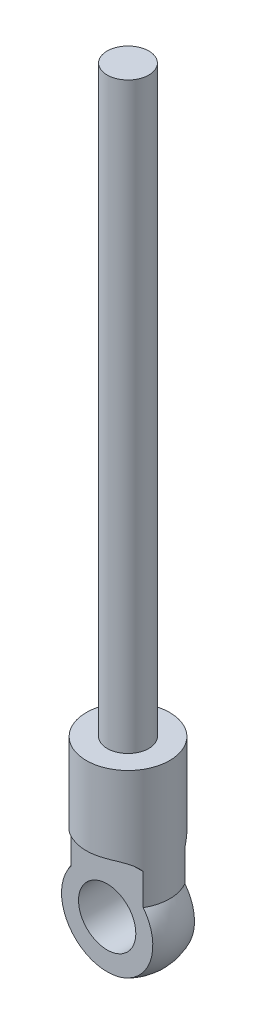
ISO-10303-21;
HEADER;
FILE_DESCRIPTION(('STEP AP214'),'2;1');
FILE_NAME('part.step','',(''),(''),'','','');
FILE_SCHEMA(('AUTOMOTIVE_DESIGN { 1 0 10303 214 1 1 1 1 }'));
ENDSEC;
DATA;
#1=APPLICATION_CONTEXT('core data for automotive mechanical design processes');
#2=APPLICATION_PROTOCOL_DEFINITION('international standard','automotive_design',2000,#1);
#3=PRODUCT_CONTEXT('',#1,'mechanical');
#4=PRODUCT('Part','Part','',(#3));
#5=PRODUCT_RELATED_PRODUCT_CATEGORY('part','',(#4));
#6=PRODUCT_DEFINITION_FORMATION('','',#4);
#7=PRODUCT_DEFINITION_CONTEXT('part definition',#1,'design');
#8=PRODUCT_DEFINITION('design','',#6,#7);
#9=PRODUCT_DEFINITION_SHAPE('','',#8);
#10=(LENGTH_UNIT() NAMED_UNIT(*) SI_UNIT(.MILLI.,.METRE.));
#11=(NAMED_UNIT(*) PLANE_ANGLE_UNIT() SI_UNIT($,.RADIAN.));
#12=(NAMED_UNIT(*) SI_UNIT($,.STERADIAN.) SOLID_ANGLE_UNIT());
#13=UNCERTAINTY_MEASURE_WITH_UNIT(LENGTH_MEASURE(1.E-05),#10,'distance_accuracy_value','');
#14=(GEOMETRIC_REPRESENTATION_CONTEXT(3) GLOBAL_UNCERTAINTY_ASSIGNED_CONTEXT((#13)) GLOBAL_UNIT_ASSIGNED_CONTEXT((#10,
#11,#12)) REPRESENTATION_CONTEXT('',''));
#15=CARTESIAN_POINT('',(0.,0.,0.));
#16=DIRECTION('',(0.,0.,1.));
#17=DIRECTION('',(1.,0.,0.));
#18=AXIS2_PLACEMENT_3D('',#15,#16,#17);
#19=CARTESIAN_POINT('',(0.,-14.1833333333333,0.));
#20=DIRECTION('',(0.,-1.,0.));
#21=DIRECTION('',(-1.,0.,0.));
#22=AXIS2_PLACEMENT_3D('',#19,#20,#21);
#23=SPHERICAL_SURFACE('',#22,4.81666666666666);
#24=CARTESIAN_POINT('',(0.,-14.1833333333333,2.));
#25=DIRECTION('',(0.,0.,-1.));
#26=DIRECTION('',(0.,1.,0.));
#27=AXIS2_PLACEMENT_3D('',#24,#25,#26);
#28=CIRCLE('',#27,4.38181215683395);
#29=CARTESIAN_POINT('',(3.46410161513775,-11.5,2.));
#30=VERTEX_POINT('',#29);
#31=CARTESIAN_POINT('',(-3.46410161513775,-11.5,2.));
#32=VERTEX_POINT('',#31);
#33=EDGE_CURVE('E167',#30,#32,#28,.T.);
#34=ORIENTED_EDGE('',*,*,#33,.T.);
#35=CARTESIAN_POINT('',(0.,-11.5,0.));
#36=DIRECTION('',(0.,-1.,0.));
#37=DIRECTION('',(0.,0.,-1.));
#38=AXIS2_PLACEMENT_3D('',#35,#36,#37);
#39=CIRCLE('',#38,4.);
#40=CARTESIAN_POINT('',(-3.46410161513775,-11.5,-2.));
#41=VERTEX_POINT('',#40);
#42=EDGE_CURVE('E170',#32,#41,#39,.T.);
#43=ORIENTED_EDGE('',*,*,#42,.T.);
#44=CARTESIAN_POINT('',(0.,-14.1833333333333,-2.));
#45=DIRECTION('',(0.,0.,-1.));
#46=DIRECTION('',(0.,1.,0.));
#47=AXIS2_PLACEMENT_3D('',#44,#45,#46);
#48=CIRCLE('',#47,4.38181215683394);
#49=CARTESIAN_POINT('',(3.46410161513775,-11.5,-2.));
#50=VERTEX_POINT('',#49);
#51=EDGE_CURVE('E74',#50,#41,#48,.T.);
#52=ORIENTED_EDGE('',*,*,#51,.F.);
#53=EDGE_CURVE('E111',#50,#30,#39,.T.);
#54=ORIENTED_EDGE('',*,*,#53,.T.);
#55=EDGE_LOOP('',(#34,#43,#52,#54));
#56=FACE_BOUND('',#55,.T.);
#57=ADVANCED_FACE('F51',(#56),#23,.T.);
#58=CARTESIAN_POINT('',(0.,0.,0.));
#59=DIRECTION('',(0.,-1.,0.));
#60=DIRECTION('',(0.,0.,-1.));
#61=AXIS2_PLACEMENT_3D('',#58,#59,#60);
#62=CYLINDRICAL_SURFACE('',#61,4.);
#63=CARTESIAN_POINT('',(0.,0.,0.));
#64=DIRECTION('',(0.,-1.,0.));
#65=DIRECTION('',(0.,0.,-1.));
#66=AXIS2_PLACEMENT_3D('',#63,#64,#65);
#67=CIRCLE('',#66,4.);
#68=CARTESIAN_POINT('',(0.,0.,-4.));
#69=VERTEX_POINT('',#68);
#70=EDGE_CURVE('E178',#69,#69,#67,.T.);
#71=ORIENTED_EDGE('',*,*,#70,.T.);
#72=EDGE_LOOP('',(#71));
#73=FACE_BOUND('',#72,.T.);
#74=CARTESIAN_POINT('',(-3.46410161513776,-11.5,2.));
#75=CARTESIAN_POINT('',(-3.48505742822508,-11.4516236882403,1.96369983455173));
#76=CARTESIAN_POINT('',(-3.50441881772126,-11.4014765354883,1.92885064757099));
#77=CARTESIAN_POINT('',(-3.54013083235496,-11.2980139730111,1.86249743017676));
#78=CARTESIAN_POINT('',(-3.55648210578561,-11.24469924877,1.83099268008719));
#79=CARTESIAN_POINT('',(-3.58633448416375,-11.135350375821,1.77180778083842));
#80=CARTESIAN_POINT('',(-3.59984056854879,-11.0793211928056,1.74412097963159));
#81=CARTESIAN_POINT('',(-3.62423191112977,-10.9648842390785,1.69285106159996));
#82=CARTESIAN_POINT('',(-3.63511712092051,-10.9064764244588,1.66926802057014));
#83=CARTESIAN_POINT('',(-3.66412623193404,-10.7283159282252,1.60512261604379));
#84=CARTESIAN_POINT('',(-3.67863206301334,-10.6055176660132,1.57110487936452));
#85=CARTESIAN_POINT('',(-3.69916546076441,-10.3555539891076,1.52213027146439));
#86=CARTESIAN_POINT('',(-3.70519167881027,-10.2283878830316,1.50717643226485));
#87=CARTESIAN_POINT('',(-3.70938882671181,-9.97149489366128,1.4968202471759));
#88=CARTESIAN_POINT('',(-3.7074591114322,-9.84175599169627,1.50166839566793));
#89=CARTESIAN_POINT('',(-3.69531469409487,-9.58494916267766,1.53130704014173));
#90=CARTESIAN_POINT('',(-3.6850986187928,-9.45788168192239,1.55610084158078));
#91=CARTESIAN_POINT('',(-3.65534567908771,-9.20948906496329,1.62476027814744));
#92=CARTESIAN_POINT('',(-3.63576592394964,-9.08819320561599,1.66871359140429));
#93=CARTESIAN_POINT('',(-3.58574617226035,-8.85564224980118,1.77363488888057));
#94=CARTESIAN_POINT('',(-3.55531023313985,-8.74438342149452,1.83459651449832));
#95=CARTESIAN_POINT('',(-3.4827089343538,-8.53733792578547,1.96886111269921));
#96=CARTESIAN_POINT('',(-3.44080057569296,-8.44127768824531,2.04188116966314));
#97=CARTESIAN_POINT('',(-3.34391896652423,-8.26425537994537,2.19693714971771));
#98=CARTESIAN_POINT('',(-3.28894821897836,-8.18329042198699,2.27897134393901));
#99=CARTESIAN_POINT('',(-3.16632115091152,-8.0382098196445,2.44643855016957));
#100=CARTESIAN_POINT('',(-3.09879023214102,-7.97394149450098,2.53183189592829));
#101=CARTESIAN_POINT('',(-2.95144285753561,-7.86082098328695,2.70216080214703));
#102=CARTESIAN_POINT('',(-2.87162310555112,-7.81197294404888,2.78709623343883));
#103=CARTESIAN_POINT('',(-2.69394312081619,-7.7245411426854,2.95960470212821));
#104=CARTESIAN_POINT('',(-2.59513069086336,-7.68716427149863,3.04679998150616));
#105=CARTESIAN_POINT('',(-2.38677154824466,-7.62556915710695,3.21264489259502));
#106=CARTESIAN_POINT('',(-2.27721493269961,-7.60136319059798,3.29128649693268));
#107=CARTESIAN_POINT('',(-2.07816266343584,-7.56772089288594,3.41928891400126));
#108=CARTESIAN_POINT('',(-1.99053951122883,-7.55610196248371,3.47104306220469));
#109=CARTESIAN_POINT('',(-1.81120713696376,-7.53713026494153,3.56790021216443));
#110=CARTESIAN_POINT('',(-1.71949635468132,-7.52977914207691,3.6130006454325));
#111=CARTESIAN_POINT('',(-1.53261960366885,-7.51817757074083,3.69615401308953));
#112=CARTESIAN_POINT('',(-1.43744940917219,-7.51393105804441,3.73419795641385));
#113=CARTESIAN_POINT('',(-1.24442093301576,-7.50754457612174,3.80288181414419));
#114=CARTESIAN_POINT('',(-1.14656290718302,-7.50540440712357,3.83352243049585));
#115=CARTESIAN_POINT('',(-0.947470687492997,-7.50238146239822,3.88755425095047));
#116=CARTESIAN_POINT('',(-0.846209055864686,-7.50151553127478,3.91084519593677));
#117=CARTESIAN_POINT('',(-0.64217764356532,-7.50043576725357,3.94947954499916));
#118=CARTESIAN_POINT('',(-0.539407843874386,-7.50022194258678,3.96482284875685));
#119=CARTESIAN_POINT('',(-0.333023763641647,-7.5000057179673,3.98746380930005));
#120=CARTESIAN_POINT('',(-0.229409810295539,-7.5000032396633,3.99476444670941));
#121=CARTESIAN_POINT('',(-0.0219267732101429,-7.4999983198757,4.00128644869187));
#122=CARTESIAN_POINT('',(0.0819423180896407,-7.49999587839321,4.00050757088553));
#123=CARTESIAN_POINT('',(0.29777691989608,-7.50001219007271,3.99048015565368));
#124=CARTESIAN_POINT('',(0.409711172077717,-7.50003268972412,3.98054539057031));
#125=CARTESIAN_POINT('',(0.632357887244195,-7.50043190502387,3.9512950059505));
#126=CARTESIAN_POINT('',(0.743070211956088,-7.50081066080032,3.93197833566896));
#127=CARTESIAN_POINT('',(0.962520204687622,-7.50257348287296,3.88409237366952));
#128=CARTESIAN_POINT('',(1.07125697425405,-7.5039579953943,3.85551897812918));
#129=CARTESIAN_POINT('',(1.28589412816036,-7.50867060713599,3.78933803047751));
#130=CARTESIAN_POINT('',(1.39179500420719,-7.51199836711052,3.75173205591885));
#131=CARTESIAN_POINT('',(1.5831570578028,-7.52101862140842,3.67457159963226));
#132=CARTESIAN_POINT('',(1.66916223985222,-7.52624369973875,3.6363073915507));
#133=CARTESIAN_POINT('',(1.83806542085,-7.5397653655292,3.55391890095554));
#134=CARTESIAN_POINT('',(1.92096394222509,-7.54806143398549,3.50979560944699));
#135=CARTESIAN_POINT('',(2.08297268266984,-7.568663912715,3.41613331905007));
#136=CARTESIAN_POINT('',(2.16208822830934,-7.58096448165086,3.36660227793519));
#137=CARTESIAN_POINT('',(2.31602285264499,-7.61061014043094,3.26261495721181));
#138=CARTESIAN_POINT('',(2.39084303844722,-7.62795392336031,3.2081599561302));
#139=CARTESIAN_POINT('',(2.51930646044854,-7.66417414726008,3.10776053039405));
#140=CARTESIAN_POINT('',(2.57393945087159,-7.68183725366142,3.06264169085348));
#141=CARTESIAN_POINT('',(2.67988593564515,-7.72131753156808,2.97037735516947));
#142=CARTESIAN_POINT('',(2.73120020849824,-7.74313372407532,2.92323233867615));
#143=CARTESIAN_POINT('',(2.83019101144801,-7.79135431775187,2.82750045801087));
#144=CARTESIAN_POINT('',(2.8778682426104,-7.81775783145003,2.77891387423191));
#145=CARTESIAN_POINT('',(2.96928366611156,-7.87549924530486,2.68101419839438));
#146=CARTESIAN_POINT('',(3.01302383150834,-7.90683465195998,2.63170148481648));
#147=CARTESIAN_POINT('',(3.09669701306069,-7.97497049462831,2.53272602248669));
#148=CARTESIAN_POINT('',(3.13659605473353,-8.01181343406049,2.48306370052988));
#149=CARTESIAN_POINT('',(3.2120022640101,-8.09085299285066,2.38471807238895));
#150=CARTESIAN_POINT('',(3.24751147949259,-8.1330470971067,2.33603431864129));
#151=CARTESIAN_POINT('',(3.31410727401972,-8.22274496647899,2.24055385745405));
#152=CARTESIAN_POINT('',(3.34519379041616,-8.27024880679143,2.19375717675185));
#153=CARTESIAN_POINT('',(3.40299180099458,-8.37030485858221,2.10298475464623));
#154=CARTESIAN_POINT('',(3.42970377441903,-8.42285651605705,2.05900870455697));
#155=CARTESIAN_POINT('',(3.49748039066586,-8.57412251046848,1.94292461255456));
#156=CARTESIAN_POINT('',(3.53419505154906,-8.67778527746387,1.87458509494025));
#157=CARTESIAN_POINT('',(3.59601020259842,-8.89673508930151,1.75311018664678));
#158=CARTESIAN_POINT('',(3.6211106842399,-9.01202214267577,1.69997480712728));
#159=CARTESIAN_POINT('',(3.66092996906082,-9.24836326617673,1.61240873426991));
#160=CARTESIAN_POINT('',(3.67585393627529,-9.36924740885467,1.57761182251698));
#161=CARTESIAN_POINT('',(3.69736051740217,-9.61557185362247,1.52653196321747));
#162=CARTESIAN_POINT('',(3.70394286967647,-9.74101229849565,1.51024959638873));
#163=CARTESIAN_POINT('',(3.70945509492467,-9.99611909135715,1.49666425836184));
#164=CARTESIAN_POINT('',(3.70819704883148,-10.1258145014297,1.49982733221703));
#165=CARTESIAN_POINT('',(3.69745356488751,-10.3828799481525,1.52611698300973));
#166=CARTESIAN_POINT('',(3.68796489432344,-10.5102490510347,1.54925140400566));
#167=CARTESIAN_POINT('',(3.659771953275,-10.7597516698588,1.61472761576265));
#168=CARTESIAN_POINT('',(3.64100965483043,-10.8818468857131,1.6571902148699));
#169=CARTESIAN_POINT('',(3.592741099643,-11.1161608643074,1.75936509106798));
#170=CARTESIAN_POINT('',(3.56325570666003,-11.2283982842667,1.8190438246826));
#171=CARTESIAN_POINT('',(3.51798148232311,-11.3626654131736,1.90373973145959));
#172=CARTESIAN_POINT('',(3.50785467605053,-11.3908664315831,1.92235042726624));
#173=CARTESIAN_POINT('',(3.48667938494603,-11.4462171408237,1.96049560162438));
#174=CARTESIAN_POINT('',(3.47563219526777,-11.4733682328313,1.98002876585539));
#175=CARTESIAN_POINT('',(3.46410161513776,-11.5,2.));
#176=B_SPLINE_CURVE_WITH_KNOTS('',3,(#74,#75,#76,#77,#78,#79,#80,#81,#82,#83,#84,#85,#86,#87,
#88,#89,#90,#91,#92,#93,#94,#95,#96,#97,#98,#99,#100,#101,#102,#103,#104,#105,#106,#107,#108,
#109,#110,#111,#112,#113,#114,#115,#116,#117,#118,#119,#120,#121,#122,#123,#124,#125,#126,#127,
#128,#129,#130,#131,#132,#133,#134,#135,#136,#137,#138,#139,#140,#141,#142,#143,#144,#145,#146,
#147,#148,#149,#150,#151,#152,#153,#154,#155,#156,#157,#158,#159,#160,#161,#162,#163,#164,#165,
#166,#167,#168,#169,#170,#171,#172,#173,#174,#175),.UNSPECIFIED.,.F.,.F.,(4,2,2,2,2,2,2,2,2,2,2,
2,2,2,2,2,2,2,2,2,2,2,2,2,2,2,2,2,2,2,2,2,2,2,2,2,2,2,2,2,2,2,2,2,2,2,2,2,2,2,4),(0.,
0.191956150665621,0.383870910960549,0.575446953519253,0.767026534043728,1.14981009539002,
1.53265452903099,1.92035683255558,2.30812340058271,2.69768341477958,3.08709798565704,
3.46841689115728,3.84966278871073,4.22728885793394,4.60501639224434,5.01447344631598,
5.42431150731335,5.73121424297416,6.03823514194969,6.34564458560031,6.65302487081047,
6.96443311960283,7.27584529902211,7.58714202976914,7.89844809921356,8.2351675519216,
8.57192472489245,8.90883139859596,9.24567927380462,9.52825201467944,9.81077702195,
10.0928917447584,10.3749334244967,10.5938045136342,10.8126240725046,11.031401345205,
11.2500683601638,11.470519489006,11.6908673849298,11.9112184018038,12.1315452624832,
12.5178770836597,12.9042091883986,13.2825020852019,13.6608068470212,14.0482131466708,
14.4357716754576,14.8257865779018,15.2150466590723,15.3208410617573,15.4264890279366),.UNSPECIFIED.);
#177=CARTESIAN_POINT('',(-3.46410161513776,-8.5,2.));
#178=VERTEX_POINT('',#177);
#179=CARTESIAN_POINT('',(3.46410161513776,-8.5,2.));
#180=VERTEX_POINT('',#179);
#181=EDGE_CURVE('E113',#178,#180,#176,.T.);
#182=ORIENTED_EDGE('',*,*,#181,.T.);
#183=DIRECTION('',(0.,-1.,0.));
#184=VECTOR('',#183,1.);
#185=CARTESIAN_POINT('',(3.46410161513775,0.,2.));
#186=LINE('',#185,#184);
#187=EDGE_CURVE('E11',#180,#30,#186,.T.);
#188=ORIENTED_EDGE('',*,*,#187,.T.);
#189=ORIENTED_EDGE('',*,*,#53,.F.);
#190=DIRECTION('',(0.,-1.,0.));
#191=VECTOR('',#190,1.);
#192=CARTESIAN_POINT('',(3.46410161513775,0.,-2.));
#193=LINE('',#192,#191);
#194=CARTESIAN_POINT('',(3.46410161513775,-8.49999999999999,-2.));
#195=VERTEX_POINT('',#194);
#196=EDGE_CURVE('E100',#195,#50,#193,.T.);
#197=ORIENTED_EDGE('',*,*,#196,.F.);
#198=CARTESIAN_POINT('',(-3.46410161513775,-11.5,-2.));
#199=CARTESIAN_POINT('',(-3.48505742822508,-11.4516236882403,-1.96369983455173));
#200=CARTESIAN_POINT('',(-3.50441881772126,-11.4014765354883,-1.92885064757099));
#201=CARTESIAN_POINT('',(-3.54013083235496,-11.2980139730111,-1.86249743017676));
#202=CARTESIAN_POINT('',(-3.55648210578561,-11.24469924877,-1.83099268008719));
#203=CARTESIAN_POINT('',(-3.58633448416375,-11.135350375821,-1.77180778083843));
#204=CARTESIAN_POINT('',(-3.59984056854879,-11.0793211928056,-1.74412097963159));
#205=CARTESIAN_POINT('',(-3.62423191112977,-10.9648842390785,-1.69285106159996));
#206=CARTESIAN_POINT('',(-3.63511712092051,-10.9064764244588,-1.66926802057014));
#207=CARTESIAN_POINT('',(-3.66412623193404,-10.7283159282252,-1.60512261604379));
#208=CARTESIAN_POINT('',(-3.67863206301334,-10.6055176660132,-1.57110487936452));
#209=CARTESIAN_POINT('',(-3.69916546076441,-10.3555539891076,-1.52213027146439));
#210=CARTESIAN_POINT('',(-3.70519167881027,-10.2283878830316,-1.50717643226485));
#211=CARTESIAN_POINT('',(-3.70938882671181,-9.97149489366128,-1.4968202471759));
#212=CARTESIAN_POINT('',(-3.7074591114322,-9.84175599169627,-1.50166839566793));
#213=CARTESIAN_POINT('',(-3.69531469409487,-9.58494916267766,-1.53130704014173));
#214=CARTESIAN_POINT('',(-3.6850986187928,-9.45788168192239,-1.55610084158078));
#215=CARTESIAN_POINT('',(-3.65534567908771,-9.20948906496329,-1.62476027814744));
#216=CARTESIAN_POINT('',(-3.63576592394964,-9.08819320561599,-1.66871359140429));
#217=CARTESIAN_POINT('',(-3.58574617226035,-8.85564224980118,-1.77363488888057));
#218=CARTESIAN_POINT('',(-3.55531023313985,-8.74438342149452,-1.83459651449832));
#219=CARTESIAN_POINT('',(-3.4827089343538,-8.53733792578547,-1.96886111269921));
#220=CARTESIAN_POINT('',(-3.44080057569296,-8.44127768824531,-2.04188116966314));
#221=CARTESIAN_POINT('',(-3.34391896652423,-8.26425537994537,-2.19693714971771));
#222=CARTESIAN_POINT('',(-3.28894821897836,-8.18329042198699,-2.27897134393901));
#223=CARTESIAN_POINT('',(-3.16632115091152,-8.0382098196445,-2.44643855016957));
#224=CARTESIAN_POINT('',(-3.09879023214102,-7.97394149450098,-2.53183189592829));
#225=CARTESIAN_POINT('',(-2.95144285753561,-7.86082098328695,-2.70216080214703));
#226=CARTESIAN_POINT('',(-2.87162310555112,-7.81197294404888,-2.78709623343883));
#227=CARTESIAN_POINT('',(-2.69394312081619,-7.72454114268539,-2.95960470212821));
#228=CARTESIAN_POINT('',(-2.59513069086336,-7.68716427149862,-3.04679998150616));
#229=CARTESIAN_POINT('',(-2.38677154824466,-7.62556915710695,-3.21264489259502));
#230=CARTESIAN_POINT('',(-2.27721493269961,-7.60136319059797,-3.29128649693268));
#231=CARTESIAN_POINT('',(-2.07816266343583,-7.56772089288594,-3.41928891400126));
#232=CARTESIAN_POINT('',(-1.99053951122883,-7.55610196248371,-3.47104306220469));
#233=CARTESIAN_POINT('',(-1.81120713696376,-7.53713026494153,-3.56790021216443));
#234=CARTESIAN_POINT('',(-1.71949635468132,-7.5297791420769,-3.6130006454325));
#235=CARTESIAN_POINT('',(-1.53261960366885,-7.51817757074083,-3.69615401308952));
#236=CARTESIAN_POINT('',(-1.43744940917219,-7.5139310580444,-3.73419795641385));
#237=CARTESIAN_POINT('',(-1.24442093301576,-7.50754457612174,-3.80288181414419));
#238=CARTESIAN_POINT('',(-1.14656290718302,-7.50540440712357,-3.83352243049585));
#239=CARTESIAN_POINT('',(-0.947470687492997,-7.50238146239822,-3.88755425095047));
#240=CARTESIAN_POINT('',(-0.846209055864686,-7.50151553127478,-3.91084519593677));
#241=CARTESIAN_POINT('',(-0.64217764356532,-7.50043576725357,-3.94947954499916));
#242=CARTESIAN_POINT('',(-0.539407843874386,-7.50022194258678,-3.96482284875685));
#243=CARTESIAN_POINT('',(-0.333023763641646,-7.50000571796729,-3.98746380930005));
#244=CARTESIAN_POINT('',(-0.229409810295539,-7.5000032396633,-3.99476444670941));
#245=CARTESIAN_POINT('',(-0.0219267732101429,-7.4999983198757,-4.00128644869187));
#246=CARTESIAN_POINT('',(0.0819423180896408,-7.49999587839321,-4.00050757088553));
#247=CARTESIAN_POINT('',(0.29777691989608,-7.5000121900727,-3.99048015565368));
#248=CARTESIAN_POINT('',(0.409711172077717,-7.50003268972412,-3.98054539057031));
#249=CARTESIAN_POINT('',(0.632357887244195,-7.50043190502386,-3.9512950059505));
#250=CARTESIAN_POINT('',(0.743070211956088,-7.50081066080031,-3.93197833566896));
#251=CARTESIAN_POINT('',(0.962520204687623,-7.50257348287295,-3.88409237366952));
#252=CARTESIAN_POINT('',(1.07125697425405,-7.5039579953943,-3.85551897812918));
#253=CARTESIAN_POINT('',(1.28589412816036,-7.50867060713599,-3.78933803047751));
#254=CARTESIAN_POINT('',(1.39179500420719,-7.51199836711052,-3.75173205591885));
#255=CARTESIAN_POINT('',(1.5831570578028,-7.52101862140842,-3.67457159963226));
#256=CARTESIAN_POINT('',(1.66916223985222,-7.52624369973875,-3.6363073915507));
#257=CARTESIAN_POINT('',(1.83806542085,-7.5397653655292,-3.55391890095554));
#258=CARTESIAN_POINT('',(1.92096394222509,-7.54806143398549,-3.50979560944699));
#259=CARTESIAN_POINT('',(2.08297268266984,-7.568663912715,-3.41613331905007));
#260=CARTESIAN_POINT('',(2.16208822830934,-7.58096448165086,-3.3666022779352));
#261=CARTESIAN_POINT('',(2.316022852645,-7.61061014043094,-3.26261495721181));
#262=CARTESIAN_POINT('',(2.39084303844722,-7.6279539233603,-3.2081599561302));
#263=CARTESIAN_POINT('',(2.51930646044854,-7.66417414726007,-3.10776053039405));
#264=CARTESIAN_POINT('',(2.57393945087159,-7.68183725366142,-3.06264169085348));
#265=CARTESIAN_POINT('',(2.67988593564515,-7.72131753156808,-2.97037735516947));
#266=CARTESIAN_POINT('',(2.73120020849824,-7.74313372407532,-2.92323233867615));
#267=CARTESIAN_POINT('',(2.83019101144801,-7.79135431775187,-2.82750045801087));
#268=CARTESIAN_POINT('',(2.8778682426104,-7.81775783145003,-2.77891387423191));
#269=CARTESIAN_POINT('',(2.96928366611156,-7.87549924530486,-2.68101419839438));
#270=CARTESIAN_POINT('',(3.01302383150834,-7.90683465195998,-2.63170148481648));
#271=CARTESIAN_POINT('',(3.09669701306069,-7.97497049462831,-2.53272602248669));
#272=CARTESIAN_POINT('',(3.13659605473353,-8.01181343406049,-2.48306370052988));
#273=CARTESIAN_POINT('',(3.2120022640101,-8.09085299285066,-2.38471807238895));
#274=CARTESIAN_POINT('',(3.24751147949259,-8.1330470971067,-2.33603431864129));
#275=CARTESIAN_POINT('',(3.31410727401972,-8.22274496647899,-2.24055385745405));
#276=CARTESIAN_POINT('',(3.34519379041616,-8.27024880679143,-2.19375717675185));
#277=CARTESIAN_POINT('',(3.40299180099458,-8.37030485858221,-2.10298475464623));
#278=CARTESIAN_POINT('',(3.42970377441903,-8.42285651605705,-2.05900870455697));
#279=CARTESIAN_POINT('',(3.49748039066586,-8.57412251046848,-1.94292461255456));
#280=CARTESIAN_POINT('',(3.53419505154906,-8.67778527746387,-1.87458509494025));
#281=CARTESIAN_POINT('',(3.59601020259842,-8.89673508930151,-1.75311018664678));
#282=CARTESIAN_POINT('',(3.6211106842399,-9.01202214267576,-1.69997480712728));
#283=CARTESIAN_POINT('',(3.66092996906082,-9.24836326617673,-1.61240873426991));
#284=CARTESIAN_POINT('',(3.67585393627528,-9.36924740885467,-1.57761182251698));
#285=CARTESIAN_POINT('',(3.69736051740217,-9.61557185362247,-1.52653196321747));
#286=CARTESIAN_POINT('',(3.70394286967647,-9.74101229849565,-1.51024959638873));
#287=CARTESIAN_POINT('',(3.70945509492467,-9.99611909135715,-1.49666425836184));
#288=CARTESIAN_POINT('',(3.70819704883148,-10.1258145014297,-1.49982733221703));
#289=CARTESIAN_POINT('',(3.69745356488751,-10.3828799481525,-1.52611698300973));
#290=CARTESIAN_POINT('',(3.68796489432344,-10.5102490510347,-1.54925140400566));
#291=CARTESIAN_POINT('',(3.65977195327499,-10.7597516698588,-1.61472761576266));
#292=CARTESIAN_POINT('',(3.64100965483043,-10.8818468857131,-1.6571902148699));
#293=CARTESIAN_POINT('',(3.592741099643,-11.1161608643074,-1.75936509106798));
#294=CARTESIAN_POINT('',(3.56325570666003,-11.2283982842667,-1.8190438246826));
#295=CARTESIAN_POINT('',(3.51798148232311,-11.3626654131736,-1.9037397314596));
#296=CARTESIAN_POINT('',(3.50785467605053,-11.3908664315831,-1.92235042726624));
#297=CARTESIAN_POINT('',(3.48667938494603,-11.4462171408237,-1.96049560162438));
#298=CARTESIAN_POINT('',(3.47563219526776,-11.4733682328313,-1.98002876585539));
#299=CARTESIAN_POINT('',(3.46410161513775,-11.5,-2.));
#300=B_SPLINE_CURVE_WITH_KNOTS('',3,(#198,#199,#200,#201,#202,#203,#204,#205,#206,#207,#208,
#209,#210,#211,#212,#213,#214,#215,#216,#217,#218,#219,#220,#221,#222,#223,#224,#225,#226,#227,
#228,#229,#230,#231,#232,#233,#234,#235,#236,#237,#238,#239,#240,#241,#242,#243,#244,#245,#246,
#247,#248,#249,#250,#251,#252,#253,#254,#255,#256,#257,#258,#259,#260,#261,#262,#263,#264,#265,
#266,#267,#268,#269,#270,#271,#272,#273,#274,#275,#276,#277,#278,#279,#280,#281,#282,#283,#284,
#285,#286,#287,#288,#289,#290,#291,#292,#293,#294,#295,#296,#297,#298,#299),.UNSPECIFIED.,.F.,
.F.,(4,2,2,2,2,2,2,2,2,2,2,2,2,2,2,2,2,2,2,2,2,2,2,2,2,2,2,2,2,2,2,2,2,2,2,2,2,2,2,2,2,2,2,2,2,
2,2,2,2,2,4),(0.,0.191956150665621,0.383870910960549,0.575446953519252,0.767026534043728,
1.14981009539002,1.53265452903099,1.92035683255558,2.30812340058271,2.69768341477958,
3.08709798565704,3.46841689115728,3.84966278871073,4.22728885793394,4.60501639224434,
5.01447344631598,5.42431150731336,5.73121424297416,6.03823514194969,6.34564458560031,
6.65302487081047,6.96443311960283,7.27584529902211,7.58714202976914,7.89844809921356,
8.2351675519216,8.57192472489245,8.90883139859596,9.24567927380462,9.52825201467944,
9.81077702195,10.0928917447584,10.3749334244967,10.5938045136342,10.8126240725046,
11.031401345205,11.2500683601638,11.470519489006,11.6908673849298,11.9112184018038,
12.1315452624832,12.5178770836597,12.9042091883986,13.2825020852019,13.6608068470212,
14.0482131466708,14.4357716754576,14.8257865779018,15.2150466590723,15.3208410617573,
15.4264890279366),.UNSPECIFIED.);
#301=CARTESIAN_POINT('',(-3.46410161513775,-8.49999999999999,-2.));
#302=VERTEX_POINT('',#301);
#303=EDGE_CURVE('E93',#302,#195,#300,.T.);
#304=ORIENTED_EDGE('',*,*,#303,.F.);
#305=DIRECTION('',(0.,-1.,0.));
#306=VECTOR('',#305,1.);
#307=CARTESIAN_POINT('',(-3.46410161513775,0.,-2.));
#308=LINE('',#307,#306);
#309=EDGE_CURVE('E101',#41,#302,#308,.F.);
#310=ORIENTED_EDGE('',*,*,#309,.F.);
#311=ORIENTED_EDGE('',*,*,#42,.F.);
#312=DIRECTION('',(0.,-1.,0.));
#313=VECTOR('',#312,1.);
#314=CARTESIAN_POINT('',(-3.46410161513775,0.,2.));
#315=LINE('',#314,#313);
#316=EDGE_CURVE('E60',#32,#178,#315,.F.);
#317=ORIENTED_EDGE('',*,*,#316,.T.);
#318=EDGE_LOOP('',(#182,#188,#189,#197,#304,#310,#311,#317));
#319=FACE_BOUND('',#318,.T.);
#320=ADVANCED_FACE('F109',(#73,#319),#62,.T.);
#321=CARTESIAN_POINT('',(-2.,0.,0.));
#322=DIRECTION('',(0.,-1.,0.));
#323=DIRECTION('',(0.,0.,-1.));
#324=AXIS2_PLACEMENT_3D('',#321,#322,#323);
#325=PLANE('',#324);
#326=ORIENTED_EDGE('',*,*,#70,.F.);
#327=EDGE_LOOP('',(#326));
#328=FACE_BOUND('',#327,.T.);
#329=CARTESIAN_POINT('',(0.,0.,0.));
#330=DIRECTION('',(0.,-1.,0.));
#331=DIRECTION('',(0.,0.,-1.));
#332=AXIS2_PLACEMENT_3D('',#329,#330,#331);
#333=CIRCLE('',#332,2.);
#334=CARTESIAN_POINT('',(0.,0.,-2.));
#335=VERTEX_POINT('',#334);
#336=EDGE_CURVE('E183',#335,#335,#333,.T.);
#337=ORIENTED_EDGE('',*,*,#336,.T.);
#338=EDGE_LOOP('',(#337));
#339=FACE_BOUND('',#338,.T.);
#340=ADVANCED_FACE('F152',(#328,#339),#325,.F.);
#341=CARTESIAN_POINT('',(0.,0.,0.));
#342=DIRECTION('',(0.,-1.,0.));
#343=DIRECTION('',(0.,0.,-1.));
#344=AXIS2_PLACEMENT_3D('',#341,#342,#343);
#345=CYLINDRICAL_SURFACE('',#344,2.);
#346=ORIENTED_EDGE('',*,*,#336,.F.);
#347=EDGE_LOOP('',(#346));
#348=FACE_BOUND('',#347,.T.);
#349=CARTESIAN_POINT('',(0.,56.,0.));
#350=DIRECTION('',(0.,-1.,0.));
#351=DIRECTION('',(0.,0.,-1.));
#352=AXIS2_PLACEMENT_3D('',#349,#350,#351);
#353=CIRCLE('',#352,2.);
#354=CARTESIAN_POINT('',(0.,56.,-2.));
#355=VERTEX_POINT('',#354);
#356=EDGE_CURVE('E173',#355,#355,#353,.T.);
#357=ORIENTED_EDGE('',*,*,#356,.T.);
#358=EDGE_LOOP('',(#357));
#359=FACE_BOUND('',#358,.T.);
#360=ADVANCED_FACE('F149',(#348,#359),#345,.T.);
#361=CARTESIAN_POINT('',(0.,56.,0.));
#362=DIRECTION('',(0.,-1.,0.));
#363=DIRECTION('',(0.,0.,-1.));
#364=AXIS2_PLACEMENT_3D('',#361,#362,#363);
#365=PLANE('',#364);
#366=ORIENTED_EDGE('',*,*,#356,.F.);
#367=EDGE_LOOP('',(#366));
#368=FACE_BOUND('',#367,.T.);
#369=ADVANCED_FACE('F146',(#368),#365,.F.);
#370=CARTESIAN_POINT('',(4.81666666666666,-10.,-4.));
#371=DIRECTION('',(-1.,0.,0.));
#372=DIRECTION('',(0.,0.,1.));
#373=AXIS2_PLACEMENT_3D('',#370,#371,#372);
#374=CYLINDRICAL_SURFACE('',#373,2.5);
#375=ORIENTED_EDGE('',*,*,#303,.T.);
#376=DIRECTION('',(-1.,0.,0.));
#377=VECTOR('',#376,1.);
#378=CARTESIAN_POINT('',(4.81666666666666,-8.49999999999999,-2.));
#379=LINE('',#378,#377);
#380=EDGE_CURVE('E96',#195,#302,#379,.T.);
#381=ORIENTED_EDGE('',*,*,#380,.T.);
#382=EDGE_LOOP('',(#375,#381));
#383=FACE_BOUND('',#382,.T.);
#384=ADVANCED_FACE('F95',(#383),#374,.F.);
#385=CARTESIAN_POINT('',(4.81666666666666,0.,-2.));
#386=DIRECTION('',(0.,0.,-1.));
#387=DIRECTION('',(0.,1.,0.));
#388=AXIS2_PLACEMENT_3D('',#385,#386,#387);
#389=PLANE('',#388);
#390=CARTESIAN_POINT('',(0.,-14.,-2.));
#391=DIRECTION('',(0.,0.,-1.));
#392=DIRECTION('',(0.,1.,0.));
#393=AXIS2_PLACEMENT_3D('',#390,#391,#392);
#394=CIRCLE('',#393,2.75);
#395=CARTESIAN_POINT('',(0.,-11.25,-2.));
#396=VERTEX_POINT('',#395);
#397=EDGE_CURVE('E105',#396,#396,#394,.T.);
#398=ORIENTED_EDGE('',*,*,#397,.F.);
#399=EDGE_LOOP('',(#398));
#400=FACE_BOUND('',#399,.T.);
#401=ORIENTED_EDGE('',*,*,#196,.T.);
#402=ORIENTED_EDGE('',*,*,#51,.T.);
#403=ORIENTED_EDGE('',*,*,#309,.T.);
#404=ORIENTED_EDGE('',*,*,#380,.F.);
#405=EDGE_LOOP('',(#401,#402,#403,#404));
#406=FACE_BOUND('',#405,.T.);
#407=ADVANCED_FACE('F103',(#400,#406),#389,.T.);
#408=CARTESIAN_POINT('',(4.81666666666666,0.,2.));
#409=DIRECTION('',(0.,0.,-1.));
#410=DIRECTION('',(0.,1.,0.));
#411=AXIS2_PLACEMENT_3D('',#408,#409,#410);
#412=PLANE('',#411);
#413=CARTESIAN_POINT('',(0.,-14.,2.));
#414=DIRECTION('',(0.,0.,-1.));
#415=DIRECTION('',(0.,1.,0.));
#416=AXIS2_PLACEMENT_3D('',#413,#414,#415);
#417=CIRCLE('',#416,2.75);
#418=CARTESIAN_POINT('',(0.,-11.25,2.));
#419=VERTEX_POINT('',#418);
#420=EDGE_CURVE('E54',#419,#419,#417,.T.);
#421=ORIENTED_EDGE('',*,*,#420,.T.);
#422=EDGE_LOOP('',(#421));
#423=FACE_BOUND('',#422,.T.);
#424=DIRECTION('',(-1.,0.,0.));
#425=VECTOR('',#424,1.);
#426=CARTESIAN_POINT('',(4.81666666666666,-8.5,2.));
#427=LINE('',#426,#425);
#428=EDGE_CURVE('E66',#180,#178,#427,.T.);
#429=ORIENTED_EDGE('',*,*,#428,.T.);
#430=ORIENTED_EDGE('',*,*,#316,.F.);
#431=ORIENTED_EDGE('',*,*,#33,.F.);
#432=ORIENTED_EDGE('',*,*,#187,.F.);
#433=EDGE_LOOP('',(#429,#430,#431,#432));
#434=FACE_BOUND('',#433,.T.);
#435=ADVANCED_FACE('F137',(#423,#434),#412,.F.);
#436=CARTESIAN_POINT('',(4.81666666666666,-10.,4.));
#437=DIRECTION('',(-1.,0.,0.));
#438=DIRECTION('',(0.,0.,1.));
#439=AXIS2_PLACEMENT_3D('',#436,#437,#438);
#440=CYLINDRICAL_SURFACE('',#439,2.5);
#441=ORIENTED_EDGE('',*,*,#428,.F.);
#442=ORIENTED_EDGE('',*,*,#181,.F.);
#443=EDGE_LOOP('',(#441,#442));
#444=FACE_BOUND('',#443,.T.);
#445=ADVANCED_FACE('F131',(#444),#440,.F.);
#446=CARTESIAN_POINT('',(0.,-14.,-4.));
#447=DIRECTION('',(0.,0.,1.));
#448=DIRECTION('',(1.,0.,0.));
#449=AXIS2_PLACEMENT_3D('',#446,#447,#448);
#450=CYLINDRICAL_SURFACE('',#449,2.75);
#451=ORIENTED_EDGE('',*,*,#397,.T.);
#452=EDGE_LOOP('',(#451));
#453=FACE_BOUND('',#452,.T.);
#454=ORIENTED_EDGE('',*,*,#420,.F.);
#455=EDGE_LOOP('',(#454));
#456=FACE_BOUND('',#455,.T.);
#457=ADVANCED_FACE('F136',(#453,#456),#450,.F.);
#458=CLOSED_SHELL('',(#57,#320,#340,#360,#369,#384,#407,#435,#445,#457));
#459=MANIFOLD_SOLID_BREP('B2',#458);
#460=ADVANCED_BREP_SHAPE_REPRESENTATION('',(#18,#459),#14);
#461=SHAPE_DEFINITION_REPRESENTATION(#9,#460);
ENDSEC;
END-ISO-10303-21;
